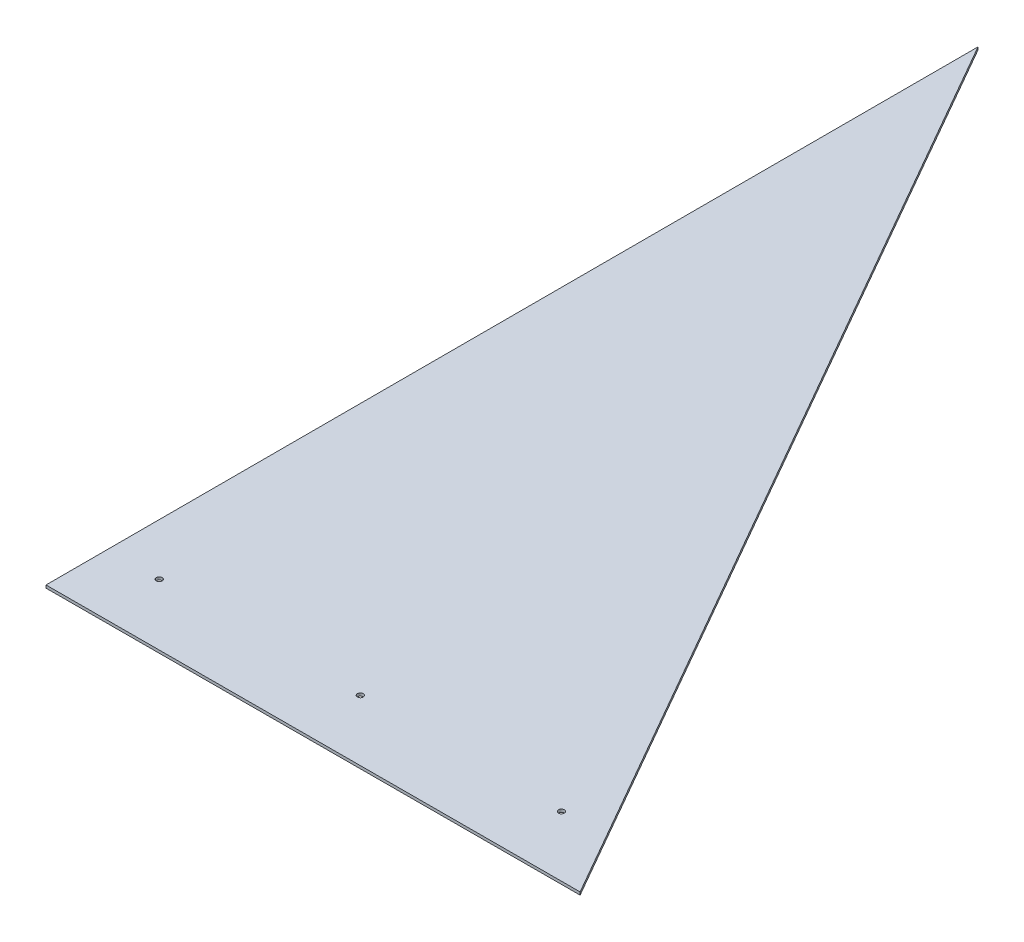
ISO-10303-21;
HEADER;
FILE_DESCRIPTION(('STEP AP214'),'2;1');
FILE_NAME('part.step','',(''),(''),'','','');
FILE_SCHEMA(('AUTOMOTIVE_DESIGN { 1 0 10303 214 1 1 1 1 }'));
ENDSEC;
DATA;
#1=APPLICATION_CONTEXT('core data for automotive mechanical design processes');
#2=APPLICATION_PROTOCOL_DEFINITION('international standard','automotive_design',2000,#1);
#3=PRODUCT_CONTEXT('',#1,'mechanical');
#4=PRODUCT('Part','Part','',(#3));
#5=PRODUCT_RELATED_PRODUCT_CATEGORY('part','',(#4));
#6=PRODUCT_DEFINITION_FORMATION('','',#4);
#7=PRODUCT_DEFINITION_CONTEXT('part definition',#1,'design');
#8=PRODUCT_DEFINITION('design','',#6,#7);
#9=PRODUCT_DEFINITION_SHAPE('','',#8);
#10=(LENGTH_UNIT() NAMED_UNIT(*) SI_UNIT(.MILLI.,.METRE.));
#11=(NAMED_UNIT(*) PLANE_ANGLE_UNIT() SI_UNIT($,.RADIAN.));
#12=(NAMED_UNIT(*) SI_UNIT($,.STERADIAN.) SOLID_ANGLE_UNIT());
#13=UNCERTAINTY_MEASURE_WITH_UNIT(LENGTH_MEASURE(1.E-05),#10,'distance_accuracy_value','');
#14=(GEOMETRIC_REPRESENTATION_CONTEXT(3) GLOBAL_UNCERTAINTY_ASSIGNED_CONTEXT((#13)) GLOBAL_UNIT_ASSIGNED_CONTEXT((#10,
#11,#12)) REPRESENTATION_CONTEXT('',''));
#15=CARTESIAN_POINT('',(0.,0.,0.));
#16=DIRECTION('',(0.,0.,1.));
#17=DIRECTION('',(1.,0.,0.));
#18=AXIS2_PLACEMENT_3D('',#15,#16,#17);
#19=CARTESIAN_POINT('',(0.,3.175,0.));
#20=DIRECTION('',(0.,1.,0.));
#21=DIRECTION('',(0.,0.,1.));
#22=AXIS2_PLACEMENT_3D('',#19,#20,#21);
#23=PLANE('',#22);
#24=CARTESIAN_POINT('',(515.9375,3.175,989.474210445894));
#25=DIRECTION('',(0.,1.,0.));
#26=DIRECTION('',(0.,0.,1.));
#27=AXIS2_PLACEMENT_3D('',#24,#25,#26);
#28=CIRCLE('',#27,3.3655);
#29=CARTESIAN_POINT('',(515.9375,3.175,992.839710445894));
#30=VERTEX_POINT('',#29);
#31=EDGE_CURVE('E79',#30,#30,#28,.F.);
#32=ORIENTED_EDGE('',*,*,#31,.T.);
#33=EDGE_LOOP('',(#32));
#34=FACE_BOUND('',#33,.T.);
#35=CARTESIAN_POINT('',(287.3375,3.175,989.474210445894));
#36=DIRECTION('',(0.,1.,0.));
#37=DIRECTION('',(0.,0.,1.));
#38=AXIS2_PLACEMENT_3D('',#35,#36,#37);
#39=CIRCLE('',#38,3.3655);
#40=CARTESIAN_POINT('',(287.3375,3.175,992.839710445894));
#41=VERTEX_POINT('',#40);
#42=EDGE_CURVE('E81',#41,#41,#39,.F.);
#43=ORIENTED_EDGE('',*,*,#42,.T.);
#44=EDGE_LOOP('',(#43));
#45=FACE_BOUND('',#44,.T.);
#46=CARTESIAN_POINT('',(58.7375,3.175,989.474210445894));
#47=DIRECTION('',(0.,1.,0.));
#48=DIRECTION('',(0.,0.,1.));
#49=AXIS2_PLACEMENT_3D('',#46,#47,#48);
#50=CIRCLE('',#49,3.3655);
#51=CARTESIAN_POINT('',(58.7375,3.175,992.839710445894));
#52=VERTEX_POINT('',#51);
#53=EDGE_CURVE('E20',#52,#52,#50,.F.);
#54=ORIENTED_EDGE('',*,*,#53,.T.);
#55=EDGE_LOOP('',(#54));
#56=FACE_BOUND('',#55,.T.);
#57=DIRECTION('',(-0.496848687610676,0.,-0.867837186123958));
#58=VECTOR('',#57,1.);
#59=CARTESIAN_POINT('',(605.757919934874,3.175,1058.06709732233));
#60=LINE('',#59,#58);
#61=CARTESIAN_POINT('',(-1.1740608485411E-11,3.175,6.82787160144471E-12));
#62=VERTEX_POINT('',#61);
#63=CARTESIAN_POINT('',(605.757919934874,3.175,1058.06709732233));
#64=VERTEX_POINT('',#63);
#65=EDGE_CURVE('E63',#62,#64,#60,.F.);
#66=ORIENTED_EDGE('',*,*,#65,.F.);
#67=DIRECTION('',(0.,0.,1.));
#68=VECTOR('',#67,1.);
#69=CARTESIAN_POINT('',(0.,3.175,0.));
#70=LINE('',#69,#68);
#71=CARTESIAN_POINT('',(0.,3.175,1059.4594));
#72=VERTEX_POINT('',#71);
#73=EDGE_CURVE('E50',#72,#62,#70,.F.);
#74=ORIENTED_EDGE('',*,*,#73,.F.);
#75=DIRECTION('',(0.999997358580386,0.,-0.00229844126537697));
#76=VECTOR('',#75,1.);
#77=CARTESIAN_POINT('',(0.,3.175,1059.4594));
#78=LINE('',#77,#76);
#79=EDGE_CURVE('E55',#64,#72,#78,.F.);
#80=ORIENTED_EDGE('',*,*,#79,.F.);
#81=EDGE_LOOP('',(#66,#74,#80));
#82=FACE_BOUND('',#81,.T.);
#83=ADVANCED_FACE('F17',(#34,#45,#56,#82),#23,.T.);
#84=CARTESIAN_POINT('',(0.,0.,0.));
#85=DIRECTION('',(-1.,0.,0.));
#86=DIRECTION('',(0.,0.,1.));
#87=AXIS2_PLACEMENT_3D('',#84,#85,#86);
#88=PLANE('',#87);
#89=DIRECTION('',(0.,1.,0.));
#90=VECTOR('',#89,1.);
#91=CARTESIAN_POINT('',(-4.70734562441066E-11,0.,2.68673971959288E-11));
#92=LINE('',#91,#90);
#93=CARTESIAN_POINT('',(-1.17683640610267E-11,0.,6.7168492989822E-12));
#94=VERTEX_POINT('',#93);
#95=EDGE_CURVE('E68',#94,#62,#92,.T.);
#96=ORIENTED_EDGE('',*,*,#95,.F.);
#97=DIRECTION('',(0.,0.,1.));
#98=VECTOR('',#97,1.);
#99=CARTESIAN_POINT('',(0.,0.,0.));
#100=LINE('',#99,#98);
#101=CARTESIAN_POINT('',(0.,0.,1059.4594));
#102=VERTEX_POINT('',#101);
#103=EDGE_CURVE('E67',#94,#102,#100,.T.);
#104=ORIENTED_EDGE('',*,*,#103,.T.);
#105=DIRECTION('',(0.,1.,0.));
#106=VECTOR('',#105,1.);
#107=CARTESIAN_POINT('',(0.,0.,1059.4594));
#108=LINE('',#107,#106);
#109=EDGE_CURVE('E58',#72,#102,#108,.F.);
#110=ORIENTED_EDGE('',*,*,#109,.F.);
#111=ORIENTED_EDGE('',*,*,#73,.T.);
#112=EDGE_LOOP('',(#96,#104,#110,#111));
#113=FACE_BOUND('',#112,.T.);
#114=ADVANCED_FACE('F66',(#113),#88,.T.);
#115=CARTESIAN_POINT('',(0.,0.,1059.4594));
#116=DIRECTION('',(0.00229844126537697,0.,0.999997358580386));
#117=DIRECTION('',(0.999997358580386,0.,-0.00229844126537697));
#118=AXIS2_PLACEMENT_3D('',#115,#116,#117);
#119=PLANE('',#118);
#120=ORIENTED_EDGE('',*,*,#109,.T.);
#121=DIRECTION('',(0.999997358580386,0.,-0.0022984412653886));
#122=VECTOR('',#121,1.);
#123=CARTESIAN_POINT('',(0.,0.,1059.4594));
#124=LINE('',#123,#122);
#125=CARTESIAN_POINT('',(605.757919934874,0.,1058.06709732233));
#126=VERTEX_POINT('',#125);
#127=EDGE_CURVE('E91',#102,#126,#124,.T.);
#128=ORIENTED_EDGE('',*,*,#127,.T.);
#129=DIRECTION('',(0.,1.,0.));
#130=VECTOR('',#129,1.);
#131=CARTESIAN_POINT('',(605.757919934874,0.,1058.06709732233));
#132=LINE('',#131,#130);
#133=EDGE_CURVE('E35',#64,#126,#132,.F.);
#134=ORIENTED_EDGE('',*,*,#133,.F.);
#135=ORIENTED_EDGE('',*,*,#79,.T.);
#136=EDGE_LOOP('',(#120,#128,#134,#135));
#137=FACE_BOUND('',#136,.T.);
#138=ADVANCED_FACE('F56',(#137),#119,.T.);
#139=CARTESIAN_POINT('',(605.757919934874,0.,1058.06709732233));
#140=DIRECTION('',(0.867837186123958,0.,-0.496848687610676));
#141=DIRECTION('',(-0.496848687610676,0.,-0.867837186123958));
#142=AXIS2_PLACEMENT_3D('',#139,#140,#141);
#143=PLANE('',#142);
#144=ORIENTED_EDGE('',*,*,#133,.T.);
#145=DIRECTION('',(-0.496848687610637,0.,-0.86783718612398));
#146=VECTOR('',#145,1.);
#147=CARTESIAN_POINT('',(605.757919934874,0.,1058.06709732233));
#148=LINE('',#147,#146);
#149=EDGE_CURVE('E78',#126,#94,#148,.T.);
#150=ORIENTED_EDGE('',*,*,#149,.T.);
#151=ORIENTED_EDGE('',*,*,#95,.T.);
#152=ORIENTED_EDGE('',*,*,#65,.T.);
#153=EDGE_LOOP('',(#144,#150,#151,#152));
#154=FACE_BOUND('',#153,.T.);
#155=ADVANCED_FACE('F93',(#154),#143,.T.);
#156=CARTESIAN_POINT('',(58.7375,3.175,989.474210445894));
#157=DIRECTION('',(0.,1.,0.));
#158=DIRECTION('',(0.,0.,1.));
#159=AXIS2_PLACEMENT_3D('',#156,#157,#158);
#160=CYLINDRICAL_SURFACE('',#159,3.3655);
#161=ORIENTED_EDGE('',*,*,#53,.F.);
#162=EDGE_LOOP('',(#161));
#163=FACE_BOUND('',#162,.T.);
#164=CARTESIAN_POINT('',(58.7375,0.,989.474210445894));
#165=DIRECTION('',(0.,1.,0.));
#166=DIRECTION('',(0.,0.,1.));
#167=AXIS2_PLACEMENT_3D('',#164,#165,#166);
#168=CIRCLE('',#167,3.3655);
#169=CARTESIAN_POINT('',(58.7375,0.,992.839710445894));
#170=VERTEX_POINT('',#169);
#171=EDGE_CURVE('E75',#170,#170,#168,.F.);
#172=ORIENTED_EDGE('',*,*,#171,.T.);
#173=EDGE_LOOP('',(#172));
#174=FACE_BOUND('',#173,.T.);
#175=ADVANCED_FACE('F112',(#163,#174),#160,.F.);
#176=CARTESIAN_POINT('',(287.3375,3.175,989.474210445894));
#177=DIRECTION('',(0.,1.,0.));
#178=DIRECTION('',(0.,0.,1.));
#179=AXIS2_PLACEMENT_3D('',#176,#177,#178);
#180=CYLINDRICAL_SURFACE('',#179,3.3655);
#181=ORIENTED_EDGE('',*,*,#42,.F.);
#182=EDGE_LOOP('',(#181));
#183=FACE_BOUND('',#182,.T.);
#184=CARTESIAN_POINT('',(287.3375,0.,989.474210445894));
#185=DIRECTION('',(0.,1.,0.));
#186=DIRECTION('',(0.,0.,1.));
#187=AXIS2_PLACEMENT_3D('',#184,#185,#186);
#188=CIRCLE('',#187,3.3655);
#189=CARTESIAN_POINT('',(287.3375,0.,992.839710445894));
#190=VERTEX_POINT('',#189);
#191=EDGE_CURVE('E26',#190,#190,#188,.F.);
#192=ORIENTED_EDGE('',*,*,#191,.T.);
#193=EDGE_LOOP('',(#192));
#194=FACE_BOUND('',#193,.T.);
#195=ADVANCED_FACE('F104',(#183,#194),#180,.F.);
#196=CARTESIAN_POINT('',(515.9375,3.175,989.474210445894));
#197=DIRECTION('',(0.,1.,0.));
#198=DIRECTION('',(0.,0.,1.));
#199=AXIS2_PLACEMENT_3D('',#196,#197,#198);
#200=CYLINDRICAL_SURFACE('',#199,3.3655);
#201=ORIENTED_EDGE('',*,*,#31,.F.);
#202=EDGE_LOOP('',(#201));
#203=FACE_BOUND('',#202,.T.);
#204=CARTESIAN_POINT('',(515.9375,0.,989.474210445894));
#205=DIRECTION('',(0.,1.,0.));
#206=DIRECTION('',(0.,0.,1.));
#207=AXIS2_PLACEMENT_3D('',#204,#205,#206);
#208=CIRCLE('',#207,3.3655);
#209=CARTESIAN_POINT('',(515.9375,0.,992.839710445894));
#210=VERTEX_POINT('',#209);
#211=EDGE_CURVE('E11',#210,#210,#208,.F.);
#212=ORIENTED_EDGE('',*,*,#211,.T.);
#213=EDGE_LOOP('',(#212));
#214=FACE_BOUND('',#213,.T.);
#215=ADVANCED_FACE('F97',(#203,#214),#200,.F.);
#216=CARTESIAN_POINT('',(0.,0.,0.));
#217=DIRECTION('',(0.,1.,0.));
#218=DIRECTION('',(0.,0.,1.));
#219=AXIS2_PLACEMENT_3D('',#216,#217,#218);
#220=PLANE('',#219);
#221=ORIENTED_EDGE('',*,*,#211,.F.);
#222=EDGE_LOOP('',(#221));
#223=FACE_BOUND('',#222,.T.);
#224=ORIENTED_EDGE('',*,*,#191,.F.);
#225=EDGE_LOOP('',(#224));
#226=FACE_BOUND('',#225,.T.);
#227=ORIENTED_EDGE('',*,*,#171,.F.);
#228=EDGE_LOOP('',(#227));
#229=FACE_BOUND('',#228,.T.);
#230=ORIENTED_EDGE('',*,*,#127,.F.);
#231=ORIENTED_EDGE('',*,*,#103,.F.);
#232=ORIENTED_EDGE('',*,*,#149,.F.);
#233=EDGE_LOOP('',(#230,#231,#232));
#234=FACE_BOUND('',#233,.T.);
#235=ADVANCED_FACE('F95',(#223,#226,#229,#234),#220,.F.);
#236=CLOSED_SHELL('',(#83,#114,#138,#155,#175,#195,#215,#235));
#237=MANIFOLD_SOLID_BREP('B1',#236);
#238=ADVANCED_BREP_SHAPE_REPRESENTATION('',(#18,#237),#14);
#239=SHAPE_DEFINITION_REPRESENTATION(#9,#238);
ENDSEC;
END-ISO-10303-21;
